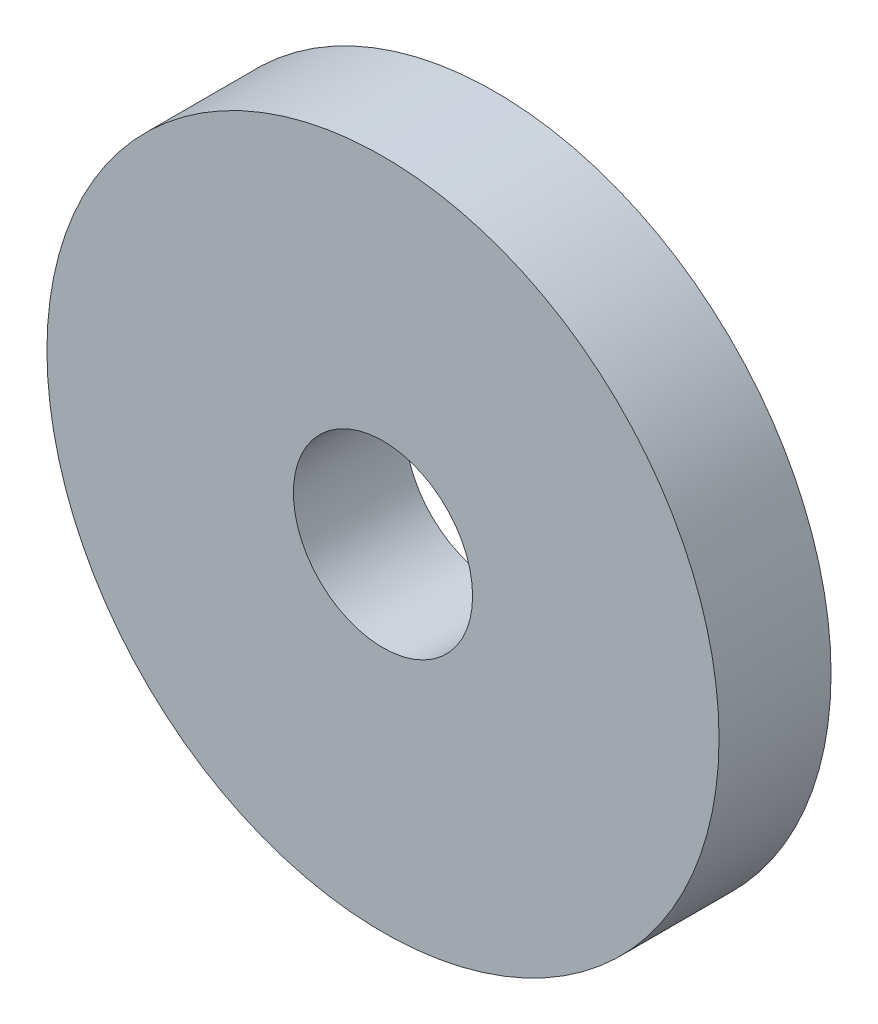
ISO-10303-21;
HEADER;
FILE_DESCRIPTION(('STEP AP214'),'2;1');
FILE_NAME('part.step','',(''),(''),'','','');
FILE_SCHEMA(('AUTOMOTIVE_DESIGN { 1 0 10303 214 1 1 1 1 }'));
ENDSEC;
DATA;
#1=APPLICATION_CONTEXT('core data for automotive mechanical design processes');
#2=APPLICATION_PROTOCOL_DEFINITION('international standard','automotive_design',2000,#1);
#3=PRODUCT_CONTEXT('',#1,'mechanical');
#4=PRODUCT('Part','Part','',(#3));
#5=PRODUCT_RELATED_PRODUCT_CATEGORY('part','',(#4));
#6=PRODUCT_DEFINITION_FORMATION('','',#4);
#7=PRODUCT_DEFINITION_CONTEXT('part definition',#1,'design');
#8=PRODUCT_DEFINITION('design','',#6,#7);
#9=PRODUCT_DEFINITION_SHAPE('','',#8);
#10=(LENGTH_UNIT() NAMED_UNIT(*) SI_UNIT(.MILLI.,.METRE.));
#11=(NAMED_UNIT(*) PLANE_ANGLE_UNIT() SI_UNIT($,.RADIAN.));
#12=(NAMED_UNIT(*) SI_UNIT($,.STERADIAN.) SOLID_ANGLE_UNIT());
#13=UNCERTAINTY_MEASURE_WITH_UNIT(LENGTH_MEASURE(1.E-05),#10,'distance_accuracy_value','');
#14=(GEOMETRIC_REPRESENTATION_CONTEXT(3) GLOBAL_UNCERTAINTY_ASSIGNED_CONTEXT((#13)) GLOBAL_UNIT_ASSIGNED_CONTEXT((#10,
#11,#12)) REPRESENTATION_CONTEXT('',''));
#15=CARTESIAN_POINT('',(0.,0.,0.));
#16=DIRECTION('',(0.,0.,1.));
#17=DIRECTION('',(1.,0.,0.));
#18=AXIS2_PLACEMENT_3D('',#15,#16,#17);
#19=CARTESIAN_POINT('',(0.,0.,2.));
#20=DIRECTION('',(0.,0.,1.));
#21=DIRECTION('',(1.,0.,0.));
#22=AXIS2_PLACEMENT_3D('',#19,#20,#21);
#23=PLANE('',#22);
#24=CARTESIAN_POINT('',(0.,0.,2.));
#25=DIRECTION('',(0.,0.,1.));
#26=DIRECTION('',(1.,0.,0.));
#27=AXIS2_PLACEMENT_3D('',#24,#25,#26);
#28=CIRCLE('',#27,6.);
#29=CARTESIAN_POINT('',(6.,0.,2.));
#30=VERTEX_POINT('',#29);
#31=EDGE_CURVE('E10',#30,#30,#28,.T.);
#32=ORIENTED_EDGE('',*,*,#31,.T.);
#33=EDGE_LOOP('',(#32));
#34=FACE_BOUND('',#33,.T.);
#35=CARTESIAN_POINT('',(0.,0.,2.));
#36=DIRECTION('',(0.,0.,1.));
#37=DIRECTION('',(1.,0.,0.));
#38=AXIS2_PLACEMENT_3D('',#35,#36,#37);
#39=CIRCLE('',#38,1.6);
#40=CARTESIAN_POINT('',(1.6,0.,2.));
#41=VERTEX_POINT('',#40);
#42=EDGE_CURVE('E43',#41,#41,#39,.T.);
#43=ORIENTED_EDGE('',*,*,#42,.F.);
#44=EDGE_LOOP('',(#43));
#45=FACE_BOUND('',#44,.T.);
#46=ADVANCED_FACE('F32',(#34,#45),#23,.T.);
#47=CARTESIAN_POINT('',(0.,0.,0.));
#48=DIRECTION('',(0.,0.,1.));
#49=DIRECTION('',(1.,0.,0.));
#50=AXIS2_PLACEMENT_3D('',#47,#48,#49);
#51=PLANE('',#50);
#52=CARTESIAN_POINT('',(0.,0.,0.));
#53=DIRECTION('',(0.,0.,1.));
#54=DIRECTION('',(1.,0.,0.));
#55=AXIS2_PLACEMENT_3D('',#52,#53,#54);
#56=CIRCLE('',#55,6.);
#57=CARTESIAN_POINT('',(6.,0.,0.));
#58=VERTEX_POINT('',#57);
#59=EDGE_CURVE('E36',#58,#58,#56,.T.);
#60=ORIENTED_EDGE('',*,*,#59,.F.);
#61=EDGE_LOOP('',(#60));
#62=FACE_BOUND('',#61,.T.);
#63=CARTESIAN_POINT('',(0.,0.,0.));
#64=DIRECTION('',(0.,0.,1.));
#65=DIRECTION('',(1.,0.,0.));
#66=AXIS2_PLACEMENT_3D('',#63,#64,#65);
#67=CIRCLE('',#66,1.6);
#68=CARTESIAN_POINT('',(1.6,0.,0.));
#69=VERTEX_POINT('',#68);
#70=EDGE_CURVE('E45',#69,#69,#67,.T.);
#71=ORIENTED_EDGE('',*,*,#70,.T.);
#72=EDGE_LOOP('',(#71));
#73=FACE_BOUND('',#72,.T.);
#74=ADVANCED_FACE('F55',(#62,#73),#51,.F.);
#75=CARTESIAN_POINT('',(0.,0.,2.));
#76=DIRECTION('',(0.,0.,-1.));
#77=DIRECTION('',(-1.,0.,0.));
#78=AXIS2_PLACEMENT_3D('',#75,#76,#77);
#79=CYLINDRICAL_SURFACE('',#78,6.);
#80=ORIENTED_EDGE('',*,*,#31,.F.);
#81=EDGE_LOOP('',(#80));
#82=FACE_BOUND('',#81,.T.);
#83=ORIENTED_EDGE('',*,*,#59,.T.);
#84=EDGE_LOOP('',(#83));
#85=FACE_BOUND('',#84,.T.);
#86=ADVANCED_FACE('F34',(#82,#85),#79,.T.);
#87=CARTESIAN_POINT('',(0.,0.,2.));
#88=DIRECTION('',(0.,0.,-1.));
#89=DIRECTION('',(-1.,0.,0.));
#90=AXIS2_PLACEMENT_3D('',#87,#88,#89);
#91=CYLINDRICAL_SURFACE('',#90,1.6);
#92=ORIENTED_EDGE('',*,*,#42,.T.);
#93=EDGE_LOOP('',(#92));
#94=FACE_BOUND('',#93,.T.);
#95=ORIENTED_EDGE('',*,*,#70,.F.);
#96=EDGE_LOOP('',(#95));
#97=FACE_BOUND('',#96,.T.);
#98=ADVANCED_FACE('F51',(#94,#97),#91,.F.);
#99=CLOSED_SHELL('',(#46,#74,#86,#98));
#100=MANIFOLD_SOLID_BREP('B2',#99);
#101=ADVANCED_BREP_SHAPE_REPRESENTATION('',(#18,#100),#14);
#102=SHAPE_DEFINITION_REPRESENTATION(#9,#101);
ENDSEC;
END-ISO-10303-21;
